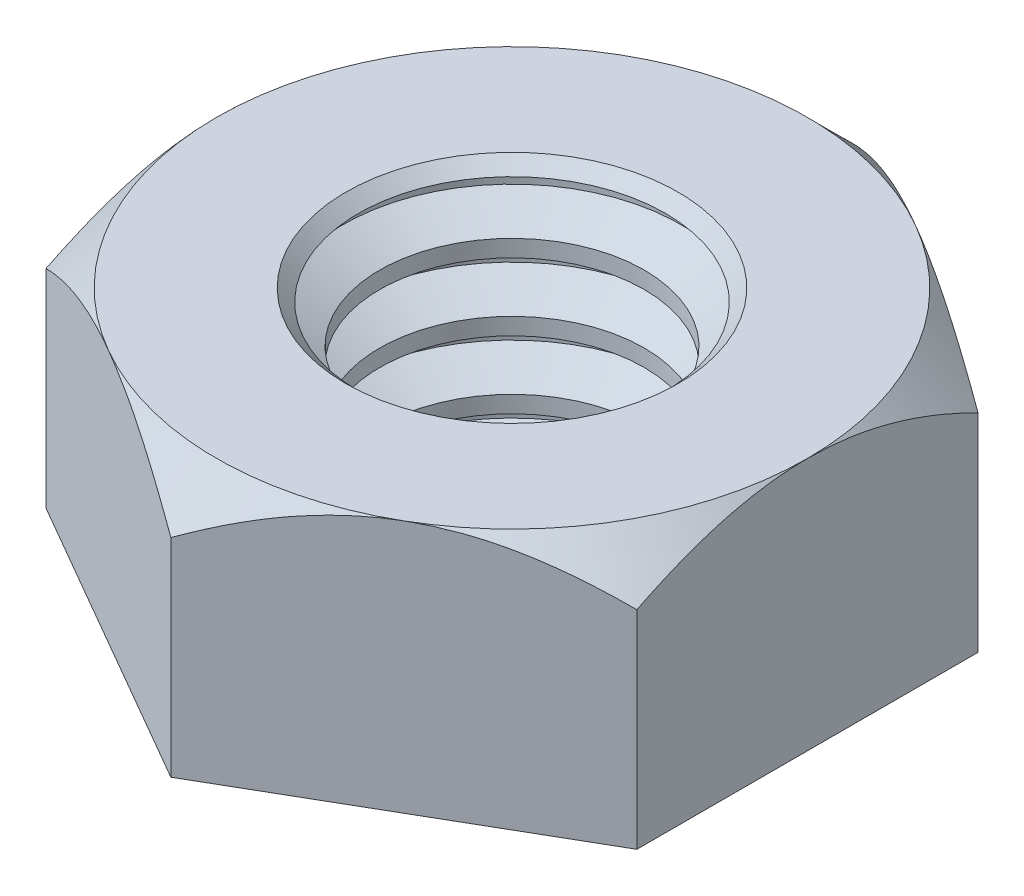
ISO-10303-21;
HEADER;
FILE_DESCRIPTION(('STEP AP214'),'2;1');
FILE_NAME('part.step','',(''),(''),'','','');
FILE_SCHEMA(('AUTOMOTIVE_DESIGN { 1 0 10303 214 1 1 1 1 }'));
ENDSEC;
DATA;
#1=APPLICATION_CONTEXT('core data for automotive mechanical design processes');
#2=APPLICATION_PROTOCOL_DEFINITION('international standard','automotive_design',2000,#1);
#3=PRODUCT_CONTEXT('',#1,'mechanical');
#4=PRODUCT('Part','Part','',(#3));
#5=PRODUCT_RELATED_PRODUCT_CATEGORY('part','',(#4));
#6=PRODUCT_DEFINITION_FORMATION('','',#4);
#7=PRODUCT_DEFINITION_CONTEXT('part definition',#1,'design');
#8=PRODUCT_DEFINITION('design','',#6,#7);
#9=PRODUCT_DEFINITION_SHAPE('','',#8);
#10=(LENGTH_UNIT() NAMED_UNIT(*) SI_UNIT(.MILLI.,.METRE.));
#11=(NAMED_UNIT(*) PLANE_ANGLE_UNIT() SI_UNIT($,.RADIAN.));
#12=(NAMED_UNIT(*) SI_UNIT($,.STERADIAN.) SOLID_ANGLE_UNIT());
#13=UNCERTAINTY_MEASURE_WITH_UNIT(LENGTH_MEASURE(1.E-05),#10,'distance_accuracy_value','');
#14=(GEOMETRIC_REPRESENTATION_CONTEXT(3) GLOBAL_UNCERTAINTY_ASSIGNED_CONTEXT((#13)) GLOBAL_UNIT_ASSIGNED_CONTEXT((#10,
#11,#12)) REPRESENTATION_CONTEXT('',''));
#15=CARTESIAN_POINT('',(0.,0.,0.));
#16=DIRECTION('',(0.,0.,1.));
#17=DIRECTION('',(1.,0.,0.));
#18=AXIS2_PLACEMENT_3D('',#15,#16,#17);
#19=CARTESIAN_POINT('',(0.,0.393578540984346,0.));
#20=DIRECTION('',(0.,1.,0.));
#21=DIRECTION('',(0.,0.,1.));
#22=AXIS2_PLACEMENT_3D('',#19,#20,#21);
#23=CYLINDRICAL_SURFACE('',#22,3.175);
#24=CARTESIAN_POINT('',(0.,3.09562500001448,0.));
#25=DIRECTION('',(0.,-1.,0.));
#26=DIRECTION('',(0.,0.,-1.));
#27=AXIS2_PLACEMENT_3D('',#24,#25,#26);
#28=CIRCLE('',#27,3.17499999994197);
#29=CARTESIAN_POINT('',(0.,3.09562500001448,-3.17499999994197));
#30=VERTEX_POINT('',#29);
#31=EDGE_CURVE('E398',#30,#30,#28,.F.);
#32=ORIENTED_EDGE('',*,*,#31,.T.);
#33=EDGE_LOOP('',(#32));
#34=FACE_BOUND('',#33,.T.);
#35=CARTESIAN_POINT('',(0.,2.9368750000458,0.));
#36=DIRECTION('',(0.,1.,0.));
#37=DIRECTION('',(0.,0.,1.));
#38=AXIS2_PLACEMENT_3D('',#35,#36,#37);
#39=CIRCLE('',#38,3.17499999999882);
#40=CARTESIAN_POINT('',(0.,2.9368750000458,3.17499999999882));
#41=VERTEX_POINT('',#40);
#42=EDGE_CURVE('E394',#41,#41,#39,.F.);
#43=ORIENTED_EDGE('',*,*,#42,.T.);
#44=EDGE_LOOP('',(#43));
#45=FACE_BOUND('',#44,.T.);
#46=ADVANCED_FACE('F17',(#34,#45),#23,.F.);
#47=CARTESIAN_POINT('',(0.,3.09562500001448,0.));
#48=DIRECTION('',(0.,-1.,0.));
#49=DIRECTION('',(1.,0.,0.));
#50=AXIS2_PLACEMENT_3D('',#47,#48,#49);
#51=CONICAL_SURFACE('',#50,3.17499999994197,1.04719755118736);
#52=ORIENTED_EDGE('',*,*,#31,.F.);
#53=EDGE_LOOP('',(#52));
#54=FACE_BOUND('',#53,.T.);
#55=CARTESIAN_POINT('',(0.,3.4925,0.));
#56=DIRECTION('',(0.,1.,0.));
#57=DIRECTION('',(0.,0.,1.));
#58=AXIS2_PLACEMENT_3D('',#55,#56,#57);
#59=CIRCLE('',#58,2.4875923357462);
#60=CARTESIAN_POINT('',(0.,3.4925,2.4875923357462));
#61=VERTEX_POINT('',#60);
#62=EDGE_CURVE('E390',#61,#61,#59,.T.);
#63=ORIENTED_EDGE('',*,*,#62,.T.);
#64=EDGE_LOOP('',(#63));
#65=FACE_BOUND('',#64,.T.);
#66=ADVANCED_FACE('F211',(#54,#65),#51,.F.);
#67=CARTESIAN_POINT('',(0.,2.9368750000458,0.));
#68=DIRECTION('',(0.,1.,0.));
#69=DIRECTION('',(0.,0.,1.));
#70=AXIS2_PLACEMENT_3D('',#67,#68,#69);
#71=CONICAL_SURFACE('',#70,3.17499999999882,1.04719755119695);
#72=ORIENTED_EDGE('',*,*,#42,.F.);
#73=EDGE_LOOP('',(#72));
#74=FACE_BOUND('',#73,.T.);
#75=CARTESIAN_POINT('',(0.,2.54,0.));
#76=DIRECTION('',(0.,1.,0.));
#77=DIRECTION('',(0.,0.,1.));
#78=AXIS2_PLACEMENT_3D('',#75,#76,#77);
#79=CIRCLE('',#78,2.4875923357462);
#80=CARTESIAN_POINT('',(0.,2.54,2.4875923357462));
#81=VERTEX_POINT('',#80);
#82=EDGE_CURVE('E386',#81,#81,#79,.F.);
#83=ORIENTED_EDGE('',*,*,#82,.T.);
#84=EDGE_LOOP('',(#83));
#85=FACE_BOUND('',#84,.T.);
#86=ADVANCED_FACE('F208',(#74,#85),#71,.F.);
#87=CARTESIAN_POINT('',(0.,1.66357854098435,0.));
#88=DIRECTION('',(0.,1.,0.));
#89=DIRECTION('',(0.,0.,1.));
#90=AXIS2_PLACEMENT_3D('',#87,#88,#89);
#91=CYLINDRICAL_SURFACE('',#90,2.4875923357462);
#92=CARTESIAN_POINT('',(0.,3.80999999998721,0.));
#93=DIRECTION('',(0.,1.,0.));
#94=DIRECTION('',(0.,0.,1.));
#95=AXIS2_PLACEMENT_3D('',#92,#93,#94);
#96=CIRCLE('',#95,2.48759233568308);
#97=CARTESIAN_POINT('',(0.,3.80999999998721,2.48759233568308));
#98=VERTEX_POINT('',#97);
#99=EDGE_CURVE('E382',#98,#98,#96,.T.);
#100=ORIENTED_EDGE('',*,*,#99,.T.);
#101=EDGE_LOOP('',(#100));
#102=FACE_BOUND('',#101,.T.);
#103=ORIENTED_EDGE('',*,*,#62,.F.);
#104=EDGE_LOOP('',(#103));
#105=FACE_BOUND('',#104,.T.);
#106=ADVANCED_FACE('F204',(#102,#105),#91,.F.);
#107=CARTESIAN_POINT('',(0.,0.393578540984346,0.));
#108=DIRECTION('',(0.,1.,0.));
#109=DIRECTION('',(0.,0.,1.));
#110=AXIS2_PLACEMENT_3D('',#107,#108,#109);
#111=CYLINDRICAL_SURFACE('',#110,2.4875923357462);
#112=ORIENTED_EDGE('',*,*,#82,.F.);
#113=EDGE_LOOP('',(#112));
#114=FACE_BOUND('',#113,.T.);
#115=CARTESIAN_POINT('',(0.,2.22250000001623,0.));
#116=DIRECTION('',(0.,-1.,0.));
#117=DIRECTION('',(0.,0.,-1.));
#118=AXIS2_PLACEMENT_3D('',#115,#116,#117);
#119=CIRCLE('',#118,2.48759233568308);
#120=CARTESIAN_POINT('',(0.,2.22250000001623,-2.48759233568308));
#121=VERTEX_POINT('',#120);
#122=EDGE_CURVE('E378',#121,#121,#119,.T.);
#123=ORIENTED_EDGE('',*,*,#122,.T.);
#124=EDGE_LOOP('',(#123));
#125=FACE_BOUND('',#124,.T.);
#126=ADVANCED_FACE('F200',(#114,#125),#111,.F.);
#127=CARTESIAN_POINT('',(0.,4.20687500002259,0.));
#128=DIRECTION('',(0.,1.,0.));
#129=DIRECTION('',(0.,0.,1.));
#130=AXIS2_PLACEMENT_3D('',#127,#128,#129);
#131=CONICAL_SURFACE('',#130,3.17499999999882,1.04719755119695);
#132=CARTESIAN_POINT('',(0.,4.206875,0.));
#133=DIRECTION('',(0.,1.,0.));
#134=DIRECTION('',(0.,0.,1.));
#135=AXIS2_PLACEMENT_3D('',#132,#133,#134);
#136=CIRCLE('',#135,3.175);
#137=CARTESIAN_POINT('',(0.,4.206875,3.175));
#138=VERTEX_POINT('',#137);
#139=EDGE_CURVE('E374',#138,#138,#136,.T.);
#140=ORIENTED_EDGE('',*,*,#139,.T.);
#141=EDGE_LOOP('',(#140));
#142=FACE_BOUND('',#141,.T.);
#143=ORIENTED_EDGE('',*,*,#99,.F.);
#144=EDGE_LOOP('',(#143));
#145=FACE_BOUND('',#144,.T.);
#146=ADVANCED_FACE('F196',(#142,#145),#131,.F.);
#147=CARTESIAN_POINT('',(0.,1.82562499998085,0.));
#148=DIRECTION('',(0.,-1.,0.));
#149=DIRECTION('',(0.,0.,-1.));
#150=AXIS2_PLACEMENT_3D('',#147,#148,#149);
#151=CONICAL_SURFACE('',#150,3.17499999999882,1.04719755119695);
#152=CARTESIAN_POINT('',(0.,1.825625,0.));
#153=DIRECTION('',(0.,1.,0.));
#154=DIRECTION('',(0.,0.,1.));
#155=AXIS2_PLACEMENT_3D('',#152,#153,#154);
#156=CIRCLE('',#155,3.175);
#157=CARTESIAN_POINT('',(0.,1.825625,3.175));
#158=VERTEX_POINT('',#157);
#159=EDGE_CURVE('E370',#158,#158,#156,.F.);
#160=ORIENTED_EDGE('',*,*,#159,.T.);
#161=EDGE_LOOP('',(#160));
#162=FACE_BOUND('',#161,.T.);
#163=ORIENTED_EDGE('',*,*,#122,.F.);
#164=EDGE_LOOP('',(#163));
#165=FACE_BOUND('',#164,.T.);
#166=ADVANCED_FACE('F192',(#162,#165),#151,.F.);
#167=CARTESIAN_POINT('',(0.,1.66357854098435,0.));
#168=DIRECTION('',(0.,1.,0.));
#169=DIRECTION('',(0.,0.,1.));
#170=AXIS2_PLACEMENT_3D('',#167,#168,#169);
#171=CYLINDRICAL_SURFACE('',#170,3.175);
#172=CARTESIAN_POINT('',(0.,4.36562499999127,0.));
#173=DIRECTION('',(0.,-1.,0.));
#174=DIRECTION('',(0.,0.,-1.));
#175=AXIS2_PLACEMENT_3D('',#172,#173,#174);
#176=CIRCLE('',#175,3.17499999994197);
#177=CARTESIAN_POINT('',(0.,4.36562499999127,-3.17499999994197));
#178=VERTEX_POINT('',#177);
#179=EDGE_CURVE('E366',#178,#178,#176,.F.);
#180=ORIENTED_EDGE('',*,*,#179,.T.);
#181=EDGE_LOOP('',(#180));
#182=FACE_BOUND('',#181,.T.);
#183=ORIENTED_EDGE('',*,*,#139,.F.);
#184=EDGE_LOOP('',(#183));
#185=FACE_BOUND('',#184,.T.);
#186=ADVANCED_FACE('F188',(#182,#185),#171,.F.);
#187=CARTESIAN_POINT('',(0.,-0.876421459015654,0.));
#188=DIRECTION('',(0.,1.,0.));
#189=DIRECTION('',(0.,0.,1.));
#190=AXIS2_PLACEMENT_3D('',#187,#188,#189);
#191=CYLINDRICAL_SURFACE('',#190,3.175);
#192=ORIENTED_EDGE('',*,*,#159,.F.);
#193=EDGE_LOOP('',(#192));
#194=FACE_BOUND('',#193,.T.);
#195=CARTESIAN_POINT('',(0.,1.66687500006901,0.));
#196=DIRECTION('',(0.,1.,0.));
#197=DIRECTION('',(0.,0.,1.));
#198=AXIS2_PLACEMENT_3D('',#195,#196,#197);
#199=CIRCLE('',#198,3.17499999999882);
#200=CARTESIAN_POINT('',(0.,1.66687500006901,3.17499999999882));
#201=VERTEX_POINT('',#200);
#202=EDGE_CURVE('E362',#201,#201,#199,.F.);
#203=ORIENTED_EDGE('',*,*,#202,.T.);
#204=EDGE_LOOP('',(#203));
#205=FACE_BOUND('',#204,.T.);
#206=ADVANCED_FACE('F184',(#194,#205),#191,.F.);
#207=CARTESIAN_POINT('',(0.,4.36562499999127,0.));
#208=DIRECTION('',(0.,-1.,0.));
#209=DIRECTION('',(0.,0.,-1.));
#210=AXIS2_PLACEMENT_3D('',#207,#208,#209);
#211=CONICAL_SURFACE('',#210,3.17499999994197,1.04719755113822);
#212=ORIENTED_EDGE('',*,*,#179,.F.);
#213=EDGE_LOOP('',(#212));
#214=FACE_BOUND('',#213,.T.);
#215=CARTESIAN_POINT('',(0.,4.53007386857962,0.));
#216=DIRECTION('',(0.,1.,0.));
#217=DIRECTION('',(0.,0.,1.));
#218=AXIS2_PLACEMENT_3D('',#215,#216,#217);
#219=CIRCLE('',#218,2.89016620433813);
#220=CARTESIAN_POINT('',(0.,4.53007386857962,2.89016620433813));
#221=VERTEX_POINT('',#220);
#222=EDGE_CURVE('E358',#221,#221,#219,.T.);
#223=ORIENTED_EDGE('',*,*,#222,.T.);
#224=EDGE_LOOP('',(#223));
#225=FACE_BOUND('',#224,.T.);
#226=ADVANCED_FACE('F180',(#214,#225),#211,.F.);
#227=CARTESIAN_POINT('',(0.,1.66687500006901,0.));
#228=DIRECTION('',(0.,1.,0.));
#229=DIRECTION('',(-1.,0.,0.));
#230=AXIS2_PLACEMENT_3D('',#227,#228,#229);
#231=CONICAL_SURFACE('',#230,3.17499999999882,1.04719755119695);
#232=ORIENTED_EDGE('',*,*,#202,.F.);
#233=EDGE_LOOP('',(#232));
#234=FACE_BOUND('',#233,.T.);
#235=CARTESIAN_POINT('',(0.,1.27,0.));
#236=DIRECTION('',(0.,1.,0.));
#237=DIRECTION('',(0.,0.,1.));
#238=AXIS2_PLACEMENT_3D('',#235,#236,#237);
#239=CIRCLE('',#238,2.4875923357462);
#240=CARTESIAN_POINT('',(0.,1.27,2.4875923357462));
#241=VERTEX_POINT('',#240);
#242=EDGE_CURVE('E354',#241,#241,#239,.F.);
#243=ORIENTED_EDGE('',*,*,#242,.T.);
#244=EDGE_LOOP('',(#243));
#245=FACE_BOUND('',#244,.T.);
#246=ADVANCED_FACE('F176',(#234,#245),#231,.F.);
#247=CARTESIAN_POINT('',(0.,4.7624999999698,0.));
#248=DIRECTION('',(0.,1.,0.));
#249=DIRECTION('',(0.,0.,1.));
#250=AXIS2_PLACEMENT_3D('',#247,#248,#249);
#251=CONICAL_SURFACE('',#250,3.12259233572831,0.785398163397448);
#252=CARTESIAN_POINT('',(0.,4.76250000002665,0.));
#253=DIRECTION('',(0.,1.,0.));
#254=DIRECTION('',(0.,0.,1.));
#255=AXIS2_PLACEMENT_3D('',#252,#253,#254);
#256=CIRCLE('',#255,3.12259233578516);
#257=CARTESIAN_POINT('',(0.,4.76250000002665,3.12259233578516));
#258=VERTEX_POINT('',#257);
#259=EDGE_CURVE('E20',#258,#258,#256,.F.);
#260=ORIENTED_EDGE('',*,*,#259,.F.);
#261=EDGE_LOOP('',(#260));
#262=FACE_BOUND('',#261,.T.);
#263=ORIENTED_EDGE('',*,*,#222,.F.);
#264=EDGE_LOOP('',(#263));
#265=FACE_BOUND('',#264,.T.);
#266=ADVANCED_FACE('F172',(#262,#265),#251,.F.);
#267=CARTESIAN_POINT('',(0.,-0.876421459015654,0.));
#268=DIRECTION('',(0.,1.,0.));
#269=DIRECTION('',(0.,0.,1.));
#270=AXIS2_PLACEMENT_3D('',#267,#268,#269);
#271=CYLINDRICAL_SURFACE('',#270,2.4875923357462);
#272=ORIENTED_EDGE('',*,*,#242,.F.);
#273=EDGE_LOOP('',(#272));
#274=FACE_BOUND('',#273,.T.);
#275=CARTESIAN_POINT('',(0.,0.952499999982592,0.));
#276=DIRECTION('',(0.,-1.,0.));
#277=DIRECTION('',(0.,0.,-1.));
#278=AXIS2_PLACEMENT_3D('',#275,#276,#277);
#279=CIRCLE('',#278,2.48759233568308);
#280=CARTESIAN_POINT('',(0.,0.952499999982592,-2.48759233568308));
#281=VERTEX_POINT('',#280);
#282=EDGE_CURVE('E119',#281,#281,#279,.T.);
#283=ORIENTED_EDGE('',*,*,#282,.T.);
#284=EDGE_LOOP('',(#283));
#285=FACE_BOUND('',#284,.T.);
#286=ADVANCED_FACE('F168',(#274,#285),#271,.F.);
#287=CARTESIAN_POINT('',(0.,4.7625,-6.4158048663707));
#288=DIRECTION('',(0.,1.,0.));
#289=DIRECTION('',(0.,0.,1.));
#290=AXIS2_PLACEMENT_3D('',#287,#288,#289);
#291=PLANE('',#290);
#292=ORIENTED_EDGE('',*,*,#259,.T.);
#293=EDGE_LOOP('',(#292));
#294=FACE_BOUND('',#293,.T.);
#295=CARTESIAN_POINT('',(0.,4.76250000002665,0.));
#296=DIRECTION('',(0.,-1.,0.));
#297=DIRECTION('',(1.,0.,0.));
#298=AXIS2_PLACEMENT_3D('',#295,#296,#297);
#299=CIRCLE('',#298,5.55624999998372);
#300=CARTESIAN_POINT('',(-2.77812499999628,4.76250000001881,4.81185364976968));
#301=VERTEX_POINT('',#300);
#302=CARTESIAN_POINT('',(-5.55624999999186,4.76250000001851,0.));
#303=VERTEX_POINT('',#302);
#304=EDGE_CURVE('E106',#301,#303,#299,.T.);
#305=ORIENTED_EDGE('',*,*,#304,.F.);
#306=CARTESIAN_POINT('',(0.,4.76250000002665,0.));
#307=DIRECTION('',(0.,-1.,0.));
#308=DIRECTION('',(1.,0.,0.));
#309=AXIS2_PLACEMENT_3D('',#306,#307,#308);
#310=CIRCLE('',#309,5.55624999998372);
#311=CARTESIAN_POINT('',(2.77812499999663,4.76250000001811,4.81185364977029));
#312=VERTEX_POINT('',#311);
#313=EDGE_CURVE('E439',#312,#301,#310,.T.);
#314=ORIENTED_EDGE('',*,*,#313,.F.);
#315=CARTESIAN_POINT('',(0.,4.76250000002665,0.));
#316=DIRECTION('',(0.,-1.,0.));
#317=DIRECTION('',(1.,0.,0.));
#318=AXIS2_PLACEMENT_3D('',#315,#316,#317);
#319=CIRCLE('',#318,5.55624999998372);
#320=CARTESIAN_POINT('',(5.55624999999186,4.76250000001851,0.));
#321=VERTEX_POINT('',#320);
#322=EDGE_CURVE('E435',#321,#312,#319,.T.);
#323=ORIENTED_EDGE('',*,*,#322,.F.);
#324=CARTESIAN_POINT('',(0.,4.76250000002665,0.));
#325=DIRECTION('',(0.,-1.,0.));
#326=DIRECTION('',(1.,0.,0.));
#327=AXIS2_PLACEMENT_3D('',#324,#325,#326);
#328=CIRCLE('',#327,5.55624999998372);
#329=CARTESIAN_POINT('',(2.77812499999628,4.76250000001881,-4.81185364976968));
#330=VERTEX_POINT('',#329);
#331=EDGE_CURVE('E113',#330,#321,#328,.T.);
#332=ORIENTED_EDGE('',*,*,#331,.F.);
#333=CARTESIAN_POINT('',(0.,4.76250000002665,0.));
#334=DIRECTION('',(0.,-1.,0.));
#335=DIRECTION('',(1.,0.,0.));
#336=AXIS2_PLACEMENT_3D('',#333,#334,#335);
#337=CIRCLE('',#336,5.55624999998372);
#338=CARTESIAN_POINT('',(-2.77812499999664,4.76250000001811,-4.81185364977029));
#339=VERTEX_POINT('',#338);
#340=EDGE_CURVE('E107',#339,#330,#337,.T.);
#341=ORIENTED_EDGE('',*,*,#340,.F.);
#342=CARTESIAN_POINT('',(0.,4.76250000002665,0.));
#343=DIRECTION('',(0.,-1.,0.));
#344=DIRECTION('',(1.,0.,0.));
#345=AXIS2_PLACEMENT_3D('',#342,#343,#344);
#346=CIRCLE('',#345,5.55624999998372);
#347=EDGE_CURVE('E95',#303,#339,#346,.T.);
#348=ORIENTED_EDGE('',*,*,#347,.F.);
#349=EDGE_LOOP('',(#305,#314,#323,#332,#341,#348));
#350=FACE_BOUND('',#349,.T.);
#351=ADVANCED_FACE('F111',(#294,#350),#291,.T.);
#352=CARTESIAN_POINT('',(0.,0.555624999947213,0.));
#353=DIRECTION('',(0.,-1.,0.));
#354=DIRECTION('',(0.,0.,-1.));
#355=AXIS2_PLACEMENT_3D('',#352,#353,#354);
#356=CONICAL_SURFACE('',#355,3.17499999999882,1.04719755119695);
#357=CARTESIAN_POINT('',(0.,0.555625,0.));
#358=DIRECTION('',(0.,1.,0.));
#359=DIRECTION('',(0.,0.,1.));
#360=AXIS2_PLACEMENT_3D('',#357,#358,#359);
#361=CIRCLE('',#360,3.175);
#362=CARTESIAN_POINT('',(0.,0.555625,3.175));
#363=VERTEX_POINT('',#362);
#364=EDGE_CURVE('E347',#363,#363,#361,.F.);
#365=ORIENTED_EDGE('',*,*,#364,.T.);
#366=EDGE_LOOP('',(#365));
#367=FACE_BOUND('',#366,.T.);
#368=ORIENTED_EDGE('',*,*,#282,.F.);
#369=EDGE_LOOP('',(#368));
#370=FACE_BOUND('',#369,.T.);
#371=ADVANCED_FACE('F159',(#367,#370),#356,.F.);
#372=CARTESIAN_POINT('',(0.,3.89778780441929,0.));
#373=DIRECTION('',(0.,-1.,0.));
#374=DIRECTION('',(1.,0.,0.));
#375=AXIS2_PLACEMENT_3D('',#372,#373,#374);
#376=CONICAL_SURFACE('',#375,6.42096219559107,0.785398163397448);
#377=CARTESIAN_POINT('',(6.89529481876337E-12,3.90294513363569,-6.41580486637468));
#378=CARTESIAN_POINT('',(-0.0961439627336396,3.95844532390917,-6.36029612360547));
#379=CARTESIAN_POINT('',(-0.193031372618446,4.01223140704246,-6.30435815142739));
#380=CARTESIAN_POINT('',(-0.388442880153431,4.1158515588541,-6.19153726494931));
#381=CARTESIAN_POINT('',(-0.48696788732396,4.16568333613507,-6.13465382553749));
#382=CARTESIAN_POINT('',(-0.786233155470481,4.30893021583434,-5.96187294241399));
#383=CARTESIAN_POINT('',(-0.989527323281032,4.39542607644725,-5.84450099990388));
#384=CARTESIAN_POINT('',(-1.39679382519758,4.54226484029359,-5.60936557539043));
#385=CARTESIAN_POINT('',(-1.60057473365511,4.60329477099655,-5.49171261303677));
#386=CARTESIAN_POINT('',(-1.90950287275686,4.67390060755758,-5.31335286876612));
#387=CARTESIAN_POINT('',(-2.01289305319051,4.6939342624413,-5.25366052026118));
#388=CARTESIAN_POINT('',(-2.22053696804989,4.72657892468336,-5.13377725012152));
#389=CARTESIAN_POINT('',(-2.32479041562654,4.73919230463678,-5.07358649409919));
#390=CARTESIAN_POINT('',(-2.48720348632817,4.75275478371739,-4.97981726400969));
#391=CARTESIAN_POINT('',(-2.54520323749661,4.7563969707123,-4.94633109205966));
#392=CARTESIAN_POINT('',(-2.66150851204991,4.76127574717194,-4.87918221048814));
#393=CARTESIAN_POINT('',(-2.71981433660856,4.76250275089465,-4.84551932698387));
#394=CARTESIAN_POINT('',(-2.7781250000009,4.76250000000958,-4.81185364977768));
#395=B_SPLINE_CURVE_WITH_KNOTS('',3,(#377,#378,#379,#380,#381,#382,#383,#384,#385,#386,#387,
#388,#389,#390,#391,#392,#393,#394),.UNSPECIFIED.,.F.,.F.,(4,2,2,2,2,2,2,2,4),(0.,
0.372329898560542,0.744873998685941,1.49437191124484,2.22208704225135,2.58505625060722,
2.94790933824143,3.14908452830525,3.35105657544868),.UNSPECIFIED.);
#396=CARTESIAN_POINT('',(-4.14845643128234E-12,3.90294513360576,-6.41580486637618));
#397=VERTEX_POINT('',#396);
#398=EDGE_CURVE('E123',#397,#339,#395,.T.);
#399=ORIENTED_EDGE('',*,*,#398,.T.);
#400=ORIENTED_EDGE('',*,*,#340,.T.);
#401=CARTESIAN_POINT('',(2.7781250000002,4.76250000001098,-4.81185364977647));
#402=CARTESIAN_POINT('',(2.70422010300177,4.76250683386859,-4.85452266195295));
#403=CARTESIAN_POINT('',(2.63032625467737,4.76053296312236,-4.89718529517449));
#404=CARTESIAN_POINT('',(2.48270514010945,4.75268818889449,-4.98241438540836));
#405=CARTESIAN_POINT('',(2.40897784949196,4.74681789843701,-5.02498085649299));
#406=CARTESIAN_POINT('',(2.18851839188986,4.72348875962961,-5.15226318368497));
#407=CARTESIAN_POINT('',(2.04221555352049,4.70031113471673,-5.23673116680073));
#408=CARTESIAN_POINT('',(1.75404619816196,4.64038711787945,-5.40310582168919));
#409=CARTESIAN_POINT('',(1.61214605160571,4.60385063940647,-5.48503190950149));
#410=CARTESIAN_POINT('',(1.33103821297734,4.51879780784092,-5.6473295958049));
#411=CARTESIAN_POINT('',(1.19183137890336,4.47027770278872,-5.72770069893055));
#412=CARTESIAN_POINT('',(0.964166818617999,4.38161278368557,-5.85914289409625));
#413=CARTESIAN_POINT('',(0.874838339318478,4.34439154490662,-5.91071671566613));
#414=CARTESIAN_POINT('',(0.697489715297436,4.26606247520845,-6.01310899148509));
#415=CARTESIAN_POINT('',(0.60946929913544,4.22495546404838,-6.06392760245041));
#416=CARTESIAN_POINT('',(0.433800560669882,4.13884739400589,-6.1653499958917));
#417=CARTESIAN_POINT('',(0.346165497068739,4.09381046496169,-6.21594612345228));
#418=CARTESIAN_POINT('',(0.172153338619018,4.00061747121535,-6.31641208997549));
#419=CARTESIAN_POINT('',(0.0857761604583926,3.95246161424692,-6.36628197703837));
#420=CARTESIAN_POINT('',(-8.29734049397602E-12,3.9029451336365,-6.41580486637387));
#421=B_SPLINE_CURVE_WITH_KNOTS('',3,(#401,#402,#403,#404,#405,#406,#407,#408,#409,#410,#411,
#412,#413,#414,#415,#416,#417,#418,#419,#420),.UNSPECIFIED.,.F.,.F.,(4,2,2,2,2,2,2,2,2,4),(0.,
0.255966854117835,0.511893446484439,1.02273516810609,1.52587247624435,2.02916751203038,
2.3580672176173,2.68689769131415,3.01912834655067,3.35133689654081),.UNSPECIFIED.);
#422=EDGE_CURVE('E129',#330,#397,#421,.T.);
#423=ORIENTED_EDGE('',*,*,#422,.T.);
#424=EDGE_LOOP('',(#399,#400,#423));
#425=FACE_BOUND('',#424,.T.);
#426=ADVANCED_FACE('F128',(#425),#376,.T.);
#427=CARTESIAN_POINT('',(0.,3.89778780441929,0.));
#428=DIRECTION('',(0.,-1.,0.));
#429=DIRECTION('',(1.,0.,0.));
#430=AXIS2_PLACEMENT_3D('',#427,#428,#429);
#431=CONICAL_SURFACE('',#430,6.42096219559107,0.785398163397448);
#432=ORIENTED_EDGE('',*,*,#347,.T.);
#433=CARTESIAN_POINT('',(-2.7781250000009,4.76250000000958,-4.81185364977768));
#434=CARTESIAN_POINT('',(-2.85202989699936,4.76250683386717,-4.76918463760118));
#435=CARTESIAN_POINT('',(-2.92592374532378,4.76053296312092,-4.72652200437962));
#436=CARTESIAN_POINT('',(-3.07354485989176,4.75268818889303,-4.64129291414572));
#437=CARTESIAN_POINT('',(-3.14727215050928,4.74681789843553,-4.59872644306107));
#438=CARTESIAN_POINT('',(-3.36773160811146,4.72348875962807,-4.47144411586905));
#439=CARTESIAN_POINT('',(-3.51403444648088,4.70031113471515,-4.38697613275326));
#440=CARTESIAN_POINT('',(-3.80220380183951,4.64038711787779,-4.22060147786474));
#441=CARTESIAN_POINT('',(-3.9441039483958,4.60385063940477,-4.13867539005241));
#442=CARTESIAN_POINT('',(-4.22521178702427,4.51879780783913,-3.97637770374895));
#443=CARTESIAN_POINT('',(-4.3644186210983,4.47027770278688,-3.89600660062326));
#444=CARTESIAN_POINT('',(-4.59208318138322,4.38161278368387,-3.76456440545783));
#445=CARTESIAN_POINT('',(-4.68141166068225,4.34439154490512,-3.71299058388823));
#446=CARTESIAN_POINT('',(-4.85876028470233,4.26606247520739,-3.61059830806982));
#447=CARTESIAN_POINT('',(-4.94678070086386,4.22495546404756,-3.55977969710478));
#448=CARTESIAN_POINT('',(-5.12244943932847,4.1388473940056,-3.45835730366403));
#449=CARTESIAN_POINT('',(-5.21008450292914,4.09381046496168,-3.40776117610373));
#450=CARTESIAN_POINT('',(-5.38409666137794,4.00061747121594,-3.30729520958104));
#451=CARTESIAN_POINT('',(-5.47047383953811,3.95246161424782,-3.25742532251843));
#452=CARTESIAN_POINT('',(-5.55625000000435,3.90294513363772,-3.20790243318319));
#453=B_SPLINE_CURVE_WITH_KNOTS('',3,(#433,#434,#435,#436,#437,#438,#439,#440,#441,#442,#443,
#444,#445,#446,#447,#448,#449,#450,#451,#452),.UNSPECIFIED.,.F.,.F.,(4,2,2,2,2,2,2,2,2,4),(0.,
0.255966854117931,0.511893446484631,1.02273516810647,1.52587247624493,2.02916751203115,
2.35806721761629,2.68689769131135,3.01912834654604,3.35133689653435),.UNSPECIFIED.);
#454=CARTESIAN_POINT('',(-5.55625000000217,3.90294513363811,-3.20790243318618));
#455=VERTEX_POINT('',#454);
#456=EDGE_CURVE('E99',#339,#455,#453,.T.);
#457=ORIENTED_EDGE('',*,*,#456,.T.);
#458=CARTESIAN_POINT('',(-5.55625,3.9029451336385,-3.20790243318916));
#459=CARTESIAN_POINT('',(-5.55625,3.95844532391186,-3.09688494765089));
#460=CARTESIAN_POINT('',(-5.55625,4.01223140704504,-2.98500900329486));
#461=CARTESIAN_POINT('',(-5.55625,4.11585155885646,-2.75936723033898));
#462=CARTESIAN_POINT('',(-5.55625,4.16568333613731,-2.64560035151549));
#463=CARTESIAN_POINT('',(-5.55625,4.30893021583627,-2.30003858526891));
#464=CARTESIAN_POINT('',(-5.55625,4.39542607644897,-2.065294700249));
#465=CARTESIAN_POINT('',(-5.55625,4.54226484029497,-1.59502385122271));
#466=CARTESIAN_POINT('',(-5.55625,4.60329477099778,-1.35971792651568));
#467=CARTESIAN_POINT('',(-5.55625,4.67390060755863,-1.00299843797484));
#468=CARTESIAN_POINT('',(-5.55625,4.69393426244229,-0.883613740965121));
#469=CARTESIAN_POINT('',(-5.55625,4.72657892468427,-0.643847200686133));
#470=CARTESIAN_POINT('',(-5.55625,4.73919230463765,-0.523465688641635));
#471=CARTESIAN_POINT('',(-5.55625,4.75275478371821,-0.33592722846299));
#472=CARTESIAN_POINT('',(-5.55625,4.7563969707131,-0.268954884563141));
#473=CARTESIAN_POINT('',(-5.55625,4.76127574717273,-0.134657121420506));
#474=CARTESIAN_POINT('',(-5.55625,4.76250275089544,-0.0673313544121817));
#475=CARTESIAN_POINT('',(-5.55625,4.76250000001037,0.));
#476=B_SPLINE_CURVE_WITH_KNOTS('',3,(#458,#459,#460,#461,#462,#463,#464,#465,#466,#467,#468,
#469,#470,#471,#472,#473,#474,#475),.UNSPECIFIED.,.F.,.F.,(4,2,2,2,2,2,2,2,4),(0.,
0.372329898560033,0.744873998684922,1.49437191124278,2.22208704224833,2.58505625060373,
2.94790933823745,3.14908452830066,3.35105657544348),.UNSPECIFIED.);
#477=EDGE_CURVE('E101',#455,#303,#476,.T.);
#478=ORIENTED_EDGE('',*,*,#477,.T.);
#479=EDGE_LOOP('',(#432,#457,#478));
#480=FACE_BOUND('',#479,.T.);
#481=ADVANCED_FACE('F97',(#480),#431,.T.);
#482=CARTESIAN_POINT('',(0.,3.89778780441929,0.));
#483=DIRECTION('',(0.,-1.,0.));
#484=DIRECTION('',(1.,0.,0.));
#485=AXIS2_PLACEMENT_3D('',#482,#483,#484);
#486=CONICAL_SURFACE('',#485,6.42096219559107,0.785398163397448);
#487=ORIENTED_EDGE('',*,*,#304,.T.);
#488=CARTESIAN_POINT('',(-5.55625,4.76250000001037,0.));
#489=CARTESIAN_POINT('',(-5.55625,4.76250683386797,0.0853380243529699));
#490=CARTESIAN_POINT('',(-5.55625,4.76053296312173,0.170663290796078));
#491=CARTESIAN_POINT('',(-5.55625,4.75268818889385,0.341121471263835));
#492=CARTESIAN_POINT('',(-5.55625,4.74681789843636,0.426254413433107));
#493=CARTESIAN_POINT('',(-5.55625,4.72348875962893,0.680819067817092));
#494=CARTESIAN_POINT('',(-5.55625,4.70031113471603,0.849755034048642));
#495=CARTESIAN_POINT('',(-5.55625,4.64038711787871,1.1825043438256));
#496=CARTESIAN_POINT('',(-5.55625,4.60385063940571,1.34635651945022));
#497=CARTESIAN_POINT('',(-5.55625,4.51879780784012,1.67095189205708));
#498=CARTESIAN_POINT('',(-5.55625,4.4702777027879,1.83169409830841));
#499=CARTESIAN_POINT('',(-5.55625,4.3816127836849,2.09457848863927));
#500=CARTESIAN_POINT('',(-5.55625,4.34439154490615,2.19772613177849));
#501=CARTESIAN_POINT('',(-5.55625,4.26606247520842,2.40251068341535));
#502=CARTESIAN_POINT('',(-5.55625,4.22495546404859,2.50414790534545));
#503=CARTESIAN_POINT('',(-5.55625,4.13884739400661,2.706992692227));
#504=CARTESIAN_POINT('',(-5.55625,4.09381046496268,2.80818494734762));
#505=CARTESIAN_POINT('',(-5.55625,4.00061747121693,3.00911688039303));
#506=CARTESIAN_POINT('',(-5.55625,3.9524616142488,3.10885665451828));
#507=CARTESIAN_POINT('',(-5.55625,3.90294513363869,3.20790243318878));
#508=B_SPLINE_CURVE_WITH_KNOTS('',3,(#488,#489,#490,#491,#492,#493,#494,#495,#496,#497,#498,
#499,#500,#501,#502,#503,#504,#505,#506,#507),.UNSPECIFIED.,.F.,.F.,(4,2,2,2,2,2,2,2,2,4),(0.,
0.255966854117877,0.511893446484525,1.02273516810626,1.52587247624461,2.02916751203073,
2.35806721761594,2.68689769131107,3.01912834654583,3.35133689653421),.UNSPECIFIED.);
#509=CARTESIAN_POINT('',(-5.55625000000203,3.90294513363869,3.20790243318525));
#510=VERTEX_POINT('',#509);
#511=EDGE_CURVE('E308',#303,#510,#508,.T.);
#512=ORIENTED_EDGE('',*,*,#511,.T.);
#513=CARTESIAN_POINT('',(-5.55625000000407,3.90294513363869,3.20790243318173));
#514=CARTESIAN_POINT('',(-5.46010603726363,3.95844532391208,3.26341117595088));
#515=CARTESIAN_POINT('',(-5.36321862737892,4.01223140704528,3.31934914812891));
#516=CARTESIAN_POINT('',(-5.16780711984414,4.11585155885675,3.43217003460687));
#517=CARTESIAN_POINT('',(-5.06928211267371,4.16568333613762,3.48905347401863));
#518=CARTESIAN_POINT('',(-4.77001684452751,4.30893021583664,3.66183435714195));
#519=CARTESIAN_POINT('',(-4.56672267671718,4.39542607644938,3.77920629965193));
#520=CARTESIAN_POINT('',(-4.15945617480106,4.54226484029545,4.01434172416513));
#521=CARTESIAN_POINT('',(-3.95567526634375,4.60329477099829,4.13199468651867));
#522=CARTESIAN_POINT('',(-3.64674712724233,4.67390060755918,4.31035443078913));
#523=CARTESIAN_POINT('',(-3.54335694680879,4.69393426244286,4.37004677929401));
#524=CARTESIAN_POINT('',(-3.33571303194964,4.72657892468485,4.48993004943353));
#525=CARTESIAN_POINT('',(-3.2314595843731,4.73919230463824,4.55012080545579));
#526=CARTESIAN_POINT('',(-3.0690465136718,4.75275478371881,4.6438900355451));
#527=CARTESIAN_POINT('',(-3.0110467625036,4.7563969707137,4.677376207495));
#528=CARTESIAN_POINT('',(-2.89474148795075,4.76127574717333,4.74452508906626));
#529=CARTESIAN_POINT('',(-2.83643566339231,4.76250275089604,4.7781879725704));
#530=CARTESIAN_POINT('',(-2.7781250000002,4.76250000001098,4.81185364977646));
#531=B_SPLINE_CURVE_WITH_KNOTS('',3,(#513,#514,#515,#516,#517,#518,#519,#520,#521,#522,#523,
#524,#525,#526,#527,#528,#529,#530),.UNSPECIFIED.,.F.,.F.,(4,2,2,2,2,2,2,2,4),(0.,
0.372329898560112,0.744873998685081,1.49437191124311,2.22208704224881,2.58505625060428,
2.94790933823808,3.14908452830113,3.35105657544378),.UNSPECIFIED.);
#532=EDGE_CURVE('E299',#510,#301,#531,.T.);
#533=ORIENTED_EDGE('',*,*,#532,.T.);
#534=EDGE_LOOP('',(#487,#512,#533));
#535=FACE_BOUND('',#534,.T.);
#536=ADVANCED_FACE('F275',(#535),#486,.T.);
#537=CARTESIAN_POINT('',(0.,3.89778780441929,0.));
#538=DIRECTION('',(0.,-1.,0.));
#539=DIRECTION('',(1.,0.,0.));
#540=AXIS2_PLACEMENT_3D('',#537,#538,#539);
#541=CONICAL_SURFACE('',#540,6.42096219559107,0.785398163397448);
#542=ORIENTED_EDGE('',*,*,#313,.T.);
#543=CARTESIAN_POINT('',(-2.7781250000002,4.76250000001098,4.81185364977646));
#544=CARTESIAN_POINT('',(-2.70422010300177,4.76250683386859,4.85452266195294));
#545=CARTESIAN_POINT('',(-2.63032625467737,4.76053296312236,4.89718529517449));
#546=CARTESIAN_POINT('',(-2.48270514010945,4.75268818889449,4.98241438540836));
#547=CARTESIAN_POINT('',(-2.40897784949196,4.74681789843701,5.02498085649299));
#548=CARTESIAN_POINT('',(-2.18851839188986,4.72348875962961,5.15226318368496));
#549=CARTESIAN_POINT('',(-2.04221555352049,4.70031113471673,5.23673116680073));
#550=CARTESIAN_POINT('',(-1.75404619816197,4.64038711787945,5.40310582168919));
#551=CARTESIAN_POINT('',(-1.61214605160572,4.60385063940647,5.48503190950149));
#552=CARTESIAN_POINT('',(-1.33103821297735,4.51879780784092,5.6473295958049));
#553=CARTESIAN_POINT('',(-1.19183137890336,4.47027770278872,5.72770069893055));
#554=CARTESIAN_POINT('',(-0.964166818618314,4.38161278368569,5.85914289409607));
#555=CARTESIAN_POINT('',(-0.874838339319102,4.34439154490688,5.91071671566577));
#556=CARTESIAN_POINT('',(-0.697489715298666,4.26606247520901,6.01310899148438));
#557=CARTESIAN_POINT('',(-0.60946929913697,4.2249554640491,6.06392760244952));
#558=CARTESIAN_POINT('',(-0.433800560672009,4.13884739400696,6.16534999589047));
#559=CARTESIAN_POINT('',(-0.346165497071163,4.09381046496295,6.21594612345088));
#560=CARTESIAN_POINT('',(-0.172153338622028,4.000617471217,6.31641208997376));
#561=CARTESIAN_POINT('',(-0.0857761604616915,3.95246161424878,6.36628197703647));
#562=CARTESIAN_POINT('',(4.71395640461881E-12,3.90294513363857,6.4158048663718));
#563=B_SPLINE_CURVE_WITH_KNOTS('',3,(#543,#544,#545,#546,#547,#548,#549,#550,#551,#552,#553,
#554,#555,#556,#557,#558,#559,#560,#561,#562),.UNSPECIFIED.,.F.,.F.,(4,2,2,2,2,2,2,2,2,4),(0.,
0.255966854117833,0.511893446484436,1.02273516810608,1.52587247624435,2.02916751203038,
2.35806721761616,2.68689769131186,3.01912834654722,3.35133689653619),.UNSPECIFIED.);
#564=CARTESIAN_POINT('',(7.28782888909489E-13,3.90294513363818,6.41580486637219));
#565=VERTEX_POINT('',#564);
#566=EDGE_CURVE('E280',#301,#565,#563,.T.);
#567=ORIENTED_EDGE('',*,*,#566,.T.);
#568=CARTESIAN_POINT('',(-3.25612052172617E-12,3.90294513363779,6.41580486637258));
#569=CARTESIAN_POINT('',(0.096143962737168,3.95844532391115,6.36029612360343));
#570=CARTESIAN_POINT('',(0.193031372621862,4.01223140704433,6.30435815142542));
#571=CARTESIAN_POINT('',(0.388442880156618,4.11585155885574,6.19153726494747));
#572=CARTESIAN_POINT('',(0.486967887327031,4.16568333613659,6.13465382553572));
#573=CARTESIAN_POINT('',(0.786233155473193,4.30893021583553,5.96187294241242));
#574=CARTESIAN_POINT('',(0.989527323283494,4.39542607644823,5.84450099990246));
#575=CARTESIAN_POINT('',(1.39679382519954,4.54226484029421,5.6093655753893));
#576=CARTESIAN_POINT('',(1.60057473365682,4.60329477099701,5.49171261303578));
#577=CARTESIAN_POINT('',(1.90950287275818,4.67390060755785,5.31335286876535));
#578=CARTESIAN_POINT('',(2.01289305319171,4.69393426244151,5.25366052026049));
#579=CARTESIAN_POINT('',(2.22053696805081,4.72657892468348,5.13377725012099));
#580=CARTESIAN_POINT('',(2.32479041562733,4.73919230463686,5.07358649409874));
#581=CARTESIAN_POINT('',(2.48720348632872,4.75275478371743,4.97981726400937));
#582=CARTESIAN_POINT('',(2.54520323749704,4.75639697071232,4.94633109205941));
#583=CARTESIAN_POINT('',(2.66150851205012,4.76127574717195,4.87918221048801));
#584=CARTESIAN_POINT('',(2.71981433660867,4.76250275089465,4.84551932698381));
#585=CARTESIAN_POINT('',(2.7781250000009,4.76250000000958,4.81185364977768));
#586=B_SPLINE_CURVE_WITH_KNOTS('',3,(#568,#569,#570,#571,#572,#573,#574,#575,#576,#577,#578,
#579,#580,#581,#582,#583,#584,#585),.UNSPECIFIED.,.F.,.F.,(4,2,2,2,2,2,2,2,4),(0.,
0.372329898560038,0.744873998684932,1.4943719112428,2.22208704224836,2.58505625060376,
2.94790933823749,3.14908452830093,3.35105657544398),.UNSPECIFIED.);
#587=EDGE_CURVE('E285',#565,#312,#586,.T.);
#588=ORIENTED_EDGE('',*,*,#587,.T.);
#589=EDGE_LOOP('',(#542,#567,#588));
#590=FACE_BOUND('',#589,.T.);
#591=ADVANCED_FACE('F268',(#590),#541,.T.);
#592=CARTESIAN_POINT('',(0.,3.89778780441929,0.));
#593=DIRECTION('',(0.,-1.,0.));
#594=DIRECTION('',(1.,0.,0.));
#595=AXIS2_PLACEMENT_3D('',#592,#593,#594);
#596=CONICAL_SURFACE('',#595,6.42096219559107,0.785398163397448);
#597=ORIENTED_EDGE('',*,*,#322,.T.);
#598=CARTESIAN_POINT('',(2.7781250000009,4.76250000000958,4.81185364977768));
#599=CARTESIAN_POINT('',(2.85202989699936,4.76250683386717,4.76918463760118));
#600=CARTESIAN_POINT('',(2.92592374532378,4.76053296312092,4.72652200437962));
#601=CARTESIAN_POINT('',(3.07354485989176,4.75268818889303,4.64129291414572));
#602=CARTESIAN_POINT('',(3.14727215050928,4.74681789843553,4.59872644306108));
#603=CARTESIAN_POINT('',(3.36773160811145,4.72348875962807,4.47144411586905));
#604=CARTESIAN_POINT('',(3.51403444648087,4.70031113471515,4.38697613275326));
#605=CARTESIAN_POINT('',(3.80220380183951,4.6403871178778,4.22060147786474));
#606=CARTESIAN_POINT('',(3.9441039483958,4.60385063940477,4.13867539005242));
#607=CARTESIAN_POINT('',(4.22521178702427,4.51879780783913,3.97637770374895));
#608=CARTESIAN_POINT('',(4.3644186210983,4.47027770278688,3.89600660062327));
#609=CARTESIAN_POINT('',(4.59208318138321,4.38161278368387,3.76456440545783));
#610=CARTESIAN_POINT('',(4.68141166068225,4.34439154490512,3.71299058388823));
#611=CARTESIAN_POINT('',(4.85876028470233,4.26606247520739,3.61059830806982));
#612=CARTESIAN_POINT('',(4.94678070086385,4.22495546404756,3.55977969710478));
#613=CARTESIAN_POINT('',(5.12244943932847,4.1388473940056,3.45835730366403));
#614=CARTESIAN_POINT('',(5.21008450292914,4.09381046496168,3.40776117610373));
#615=CARTESIAN_POINT('',(5.38409666137794,4.00061747121594,3.30729520958104));
#616=CARTESIAN_POINT('',(5.47047383953811,3.95246161424782,3.25742532251843));
#617=CARTESIAN_POINT('',(5.55625000000435,3.90294513363772,3.20790243318319));
#618=B_SPLINE_CURVE_WITH_KNOTS('',3,(#598,#599,#600,#601,#602,#603,#604,#605,#606,#607,#608,
#609,#610,#611,#612,#613,#614,#615,#616,#617),.UNSPECIFIED.,.F.,.F.,(4,2,2,2,2,2,2,2,2,4),(0.,
0.25596685411793,0.511893446484631,1.02273516810647,1.52587247624493,2.02916751203115,
2.35806721761629,2.68689769131135,3.01912834654604,3.35133689653435),.UNSPECIFIED.);
#619=CARTESIAN_POINT('',(5.55625000000217,3.90294513363811,3.20790243318618));
#620=VERTEX_POINT('',#619);
#621=EDGE_CURVE('E258',#312,#620,#618,.T.);
#622=ORIENTED_EDGE('',*,*,#621,.T.);
#623=CARTESIAN_POINT('',(5.55625,3.9029451336385,3.20790243318916));
#624=CARTESIAN_POINT('',(5.55625,3.95844532391186,3.09688494765089));
#625=CARTESIAN_POINT('',(5.55625,4.01223140704504,2.98500900329486));
#626=CARTESIAN_POINT('',(5.55625,4.11585155885646,2.75936723033898));
#627=CARTESIAN_POINT('',(5.55625,4.16568333613731,2.64560035151549));
#628=CARTESIAN_POINT('',(5.55625,4.30893021583627,2.30003858526891));
#629=CARTESIAN_POINT('',(5.55625,4.39542607644897,2.065294700249));
#630=CARTESIAN_POINT('',(5.55625,4.54226484029497,1.59502385122271));
#631=CARTESIAN_POINT('',(5.55625,4.60329477099778,1.35971792651568));
#632=CARTESIAN_POINT('',(5.55625,4.67390060755863,1.00299843797485));
#633=CARTESIAN_POINT('',(5.55625,4.69393426244229,0.883613740965122));
#634=CARTESIAN_POINT('',(5.55625,4.72657892468427,0.643847200686134));
#635=CARTESIAN_POINT('',(5.55625,4.73919230463765,0.523465688641636));
#636=CARTESIAN_POINT('',(5.55625,4.75275478371821,0.335927228462992));
#637=CARTESIAN_POINT('',(5.55625,4.7563969707131,0.268954884563142));
#638=CARTESIAN_POINT('',(5.55625,4.76127574717273,0.134657121420507));
#639=CARTESIAN_POINT('',(5.55625,4.76250275089544,0.0673313544121821));
#640=CARTESIAN_POINT('',(5.55625,4.76250000001037,0.));
#641=B_SPLINE_CURVE_WITH_KNOTS('',3,(#623,#624,#625,#626,#627,#628,#629,#630,#631,#632,#633,
#634,#635,#636,#637,#638,#639,#640),.UNSPECIFIED.,.F.,.F.,(4,2,2,2,2,2,2,2,4),(0.,
0.372329898560032,0.744873998684921,1.49437191124278,2.22208704224833,2.58505625060373,
2.94790933823745,3.14908452830066,3.35105657544348),.UNSPECIFIED.);
#642=EDGE_CURVE('E250',#620,#321,#641,.T.);
#643=ORIENTED_EDGE('',*,*,#642,.T.);
#644=EDGE_LOOP('',(#597,#622,#643));
#645=FACE_BOUND('',#644,.T.);
#646=ADVANCED_FACE('F263',(#645),#596,.T.);
#647=CARTESIAN_POINT('',(0.,3.89778780441929,0.));
#648=DIRECTION('',(0.,-1.,0.));
#649=DIRECTION('',(1.,0.,0.));
#650=AXIS2_PLACEMENT_3D('',#647,#648,#649);
#651=CONICAL_SURFACE('',#650,6.42096219559107,0.785398163397448);
#652=CARTESIAN_POINT('',(5.55625,4.76250000001037,0.));
#653=CARTESIAN_POINT('',(5.55625,4.76250683386797,-0.0853380243529698));
#654=CARTESIAN_POINT('',(5.55625,4.76053296312173,-0.170663290796077));
#655=CARTESIAN_POINT('',(5.55625,4.75268818889385,-0.341121471263835));
#656=CARTESIAN_POINT('',(5.55625,4.74681789843636,-0.426254413433106));
#657=CARTESIAN_POINT('',(5.55625,4.72348875962893,-0.680819067817092));
#658=CARTESIAN_POINT('',(5.55625,4.70031113471603,-0.849755034048642));
#659=CARTESIAN_POINT('',(5.55625,4.64038711787871,-1.1825043438256));
#660=CARTESIAN_POINT('',(5.55625,4.60385063940571,-1.34635651945022));
#661=CARTESIAN_POINT('',(5.55625,4.51879780784012,-1.67095189205708));
#662=CARTESIAN_POINT('',(5.55625,4.4702777027879,-1.83169409830841));
#663=CARTESIAN_POINT('',(5.55625,4.3816127836849,-2.09457848863927));
#664=CARTESIAN_POINT('',(5.55625,4.34439154490615,-2.19772613177849));
#665=CARTESIAN_POINT('',(5.55625,4.26606247520842,-2.40251068341535));
#666=CARTESIAN_POINT('',(5.55625,4.22495546404859,-2.50414790534545));
#667=CARTESIAN_POINT('',(5.55625,4.13884739400661,-2.706992692227));
#668=CARTESIAN_POINT('',(5.55625,4.09381046496268,-2.80818494734762));
#669=CARTESIAN_POINT('',(5.55625,4.00061747121693,-3.00911688039303));
#670=CARTESIAN_POINT('',(5.55625,3.9524616142488,-3.10885665451828));
#671=CARTESIAN_POINT('',(5.55625,3.90294513363869,-3.20790243318878));
#672=B_SPLINE_CURVE_WITH_KNOTS('',3,(#652,#653,#654,#655,#656,#657,#658,#659,#660,#661,#662,
#663,#664,#665,#666,#667,#668,#669,#670,#671),.UNSPECIFIED.,.F.,.F.,(4,2,2,2,2,2,2,2,2,4),(0.,
0.255966854117877,0.511893446484524,1.02273516810626,1.52587247624461,2.02916751203073,
2.35806721761594,2.68689769131107,3.01912834654583,3.35133689653421),.UNSPECIFIED.);
#673=CARTESIAN_POINT('',(5.55625000000203,3.90294513363987,-3.20790243318291));
#674=VERTEX_POINT('',#673);
#675=EDGE_CURVE('E244',#321,#674,#672,.T.);
#676=ORIENTED_EDGE('',*,*,#675,.T.);
#677=CARTESIAN_POINT('',(5.55625000000407,3.90294513363869,-3.20790243318173));
#678=CARTESIAN_POINT('',(5.46010603726363,3.95844532391208,-3.26341117595088));
#679=CARTESIAN_POINT('',(5.36321862737892,4.01223140704528,-3.31934914812891));
#680=CARTESIAN_POINT('',(5.16780711984414,4.11585155885674,-3.43217003460687));
#681=CARTESIAN_POINT('',(5.06928211267371,4.16568333613762,-3.48905347401863));
#682=CARTESIAN_POINT('',(4.77001684452751,4.30893021583664,-3.66183435714195));
#683=CARTESIAN_POINT('',(4.56672267671717,4.39542607644938,-3.77920629965193));
#684=CARTESIAN_POINT('',(4.15945617480106,4.54226484029545,-4.01434172416513));
#685=CARTESIAN_POINT('',(3.95567526634375,4.60329477099829,-4.13199468651867));
#686=CARTESIAN_POINT('',(3.64674712724233,4.67390060755918,-4.31035443078913));
#687=CARTESIAN_POINT('',(3.54335694680879,4.69393426244286,-4.37004677929401));
#688=CARTESIAN_POINT('',(3.33571303194964,4.72657892468485,-4.48993004943353));
#689=CARTESIAN_POINT('',(3.2314595843731,4.73919230463824,-4.55012080545579));
#690=CARTESIAN_POINT('',(3.0690465136718,4.75275478371881,-4.6438900355451));
#691=CARTESIAN_POINT('',(3.0110467625036,4.7563969707137,-4.677376207495));
#692=CARTESIAN_POINT('',(2.89474148795075,4.76127574717333,-4.74452508906627));
#693=CARTESIAN_POINT('',(2.83643566339231,4.76250275089604,-4.7781879725704));
#694=CARTESIAN_POINT('',(2.7781250000002,4.76250000001098,-4.81185364977647));
#695=B_SPLINE_CURVE_WITH_KNOTS('',3,(#677,#678,#679,#680,#681,#682,#683,#684,#685,#686,#687,
#688,#689,#690,#691,#692,#693,#694),.UNSPECIFIED.,.F.,.F.,(4,2,2,2,2,2,2,2,4),(0.,
0.372329898560112,0.744873998685081,1.49437191124311,2.22208704224881,2.58505625060428,
2.94790933823808,3.14908452830113,3.35105657544378),.UNSPECIFIED.);
#696=EDGE_CURVE('E137',#674,#330,#695,.T.);
#697=ORIENTED_EDGE('',*,*,#696,.T.);
#698=ORIENTED_EDGE('',*,*,#331,.T.);
#699=EDGE_LOOP('',(#676,#697,#698));
#700=FACE_BOUND('',#699,.T.);
#701=ADVANCED_FACE('F267',(#700),#651,.T.);
#702=CARTESIAN_POINT('',(0.,-2.14642145901565,0.));
#703=DIRECTION('',(0.,1.,0.));
#704=DIRECTION('',(0.,0.,1.));
#705=AXIS2_PLACEMENT_3D('',#702,#703,#704);
#706=CYLINDRICAL_SURFACE('',#705,3.175);
#707=ORIENTED_EDGE('',*,*,#364,.F.);
#708=EDGE_LOOP('',(#707));
#709=FACE_BOUND('',#708,.T.);
#710=CARTESIAN_POINT('',(0.,0.396875000035379,0.));
#711=DIRECTION('',(0.,1.,0.));
#712=DIRECTION('',(0.,0.,1.));
#713=AXIS2_PLACEMENT_3D('',#710,#711,#712);
#714=CIRCLE('',#713,3.17499999999882);
#715=CARTESIAN_POINT('',(0.,0.396875000035379,3.17499999999882));
#716=VERTEX_POINT('',#715);
#717=EDGE_CURVE('E315',#716,#716,#714,.F.);
#718=ORIENTED_EDGE('',*,*,#717,.T.);
#719=EDGE_LOOP('',(#718));
#720=FACE_BOUND('',#719,.T.);
#721=ADVANCED_FACE('F530',(#709,#720),#706,.F.);
#722=CARTESIAN_POINT('',(5.55625,4.7625,-3.20790243318408));
#723=DIRECTION('',(-0.500000000000017,0.,0.866025403784429));
#724=DIRECTION('',(0.866025403784429,0.,0.500000000000017));
#725=AXIS2_PLACEMENT_3D('',#722,#723,#724);
#726=PLANE('',#725);
#727=DIRECTION('',(-0.86602540378432,0.,-0.500000000000206));
#728=VECTOR('',#727,1.);
#729=CARTESIAN_POINT('',(5.55625,0.,-3.20790243318408));
#730=LINE('',#729,#728);
#731=CARTESIAN_POINT('',(5.55625,0.,-3.20790243318408));
#732=VERTEX_POINT('',#731);
#733=CARTESIAN_POINT('',(-1.75186495368156E-13,0.,-6.4158048663706));
#734=VERTEX_POINT('',#733);
#735=EDGE_CURVE('E319',#732,#734,#730,.T.);
#736=ORIENTED_EDGE('',*,*,#735,.T.);
#737=DIRECTION('',(0.,1.,0.));
#738=VECTOR('',#737,1.);
#739=CARTESIAN_POINT('',(0.,4.7625,-6.4158048663707));
#740=LINE('',#739,#738);
#741=EDGE_CURVE('E126',#734,#397,#740,.T.);
#742=ORIENTED_EDGE('',*,*,#741,.T.);
#743=ORIENTED_EDGE('',*,*,#422,.F.);
#744=ORIENTED_EDGE('',*,*,#696,.F.);
#745=DIRECTION('',(0.,1.,0.));
#746=VECTOR('',#745,1.);
#747=CARTESIAN_POINT('',(5.55625,4.7625,-3.20790243318408));
#748=LINE('',#747,#746);
#749=EDGE_CURVE('E461',#674,#732,#748,.F.);
#750=ORIENTED_EDGE('',*,*,#749,.T.);
#751=EDGE_LOOP('',(#736,#742,#743,#744,#750));
#752=FACE_BOUND('',#751,.T.);
#753=ADVANCED_FACE('F474',(#752),#726,.F.);
#754=CARTESIAN_POINT('',(0.,4.7625,-6.4158048663707));
#755=DIRECTION('',(0.500000000000017,0.,0.866025403784429));
#756=DIRECTION('',(0.866025403784429,0.,-0.500000000000017));
#757=AXIS2_PLACEMENT_3D('',#754,#755,#756);
#758=PLANE('',#757);
#759=DIRECTION('',(-0.86602540378432,0.,0.500000000000206));
#760=VECTOR('',#759,1.);
#761=CARTESIAN_POINT('',(0.,0.,-6.4158048663707));
#762=LINE('',#761,#760);
#763=CARTESIAN_POINT('',(-5.55625,0.,-3.20790243318438));
#764=VERTEX_POINT('',#763);
#765=EDGE_CURVE('E331',#734,#764,#762,.T.);
#766=ORIENTED_EDGE('',*,*,#765,.T.);
#767=DIRECTION('',(0.,1.,0.));
#768=VECTOR('',#767,1.);
#769=CARTESIAN_POINT('',(-5.55625,4.7625,-3.20790243318408));
#770=LINE('',#769,#768);
#771=EDGE_CURVE('E124',#764,#455,#770,.T.);
#772=ORIENTED_EDGE('',*,*,#771,.T.);
#773=ORIENTED_EDGE('',*,*,#456,.F.);
#774=ORIENTED_EDGE('',*,*,#398,.F.);
#775=ORIENTED_EDGE('',*,*,#741,.F.);
#776=EDGE_LOOP('',(#766,#772,#773,#774,#775));
#777=FACE_BOUND('',#776,.T.);
#778=ADVANCED_FACE('F122',(#777),#758,.F.);
#779=CARTESIAN_POINT('',(-5.55625,4.7625,-3.20790243318408));
#780=DIRECTION('',(1.,0.,0.));
#781=DIRECTION('',(0.,0.,-1.));
#782=AXIS2_PLACEMENT_3D('',#779,#780,#781);
#783=PLANE('',#782);
#784=DIRECTION('',(0.,0.,1.));
#785=VECTOR('',#784,1.);
#786=CARTESIAN_POINT('',(-5.55625,0.,-6.4158048663707));
#787=LINE('',#786,#785);
#788=CARTESIAN_POINT('',(-5.55625,0.,3.20790243318408));
#789=VERTEX_POINT('',#788);
#790=EDGE_CURVE('E336',#764,#789,#787,.T.);
#791=ORIENTED_EDGE('',*,*,#790,.T.);
#792=DIRECTION('',(0.,1.,0.));
#793=VECTOR('',#792,1.);
#794=CARTESIAN_POINT('',(-5.55625,4.7625,3.20790243318408));
#795=LINE('',#794,#793);
#796=EDGE_CURVE('E290',#789,#510,#795,.T.);
#797=ORIENTED_EDGE('',*,*,#796,.T.);
#798=ORIENTED_EDGE('',*,*,#511,.F.);
#799=ORIENTED_EDGE('',*,*,#477,.F.);
#800=ORIENTED_EDGE('',*,*,#771,.F.);
#801=EDGE_LOOP('',(#791,#797,#798,#799,#800));
#802=FACE_BOUND('',#801,.T.);
#803=ADVANCED_FACE('F475',(#802),#783,.F.);
#804=CARTESIAN_POINT('',(-5.55625,4.7625,3.20790243318408));
#805=DIRECTION('',(0.500000000000017,0.,-0.866025403784429));
#806=DIRECTION('',(-0.866025403784429,0.,-0.500000000000017));
#807=AXIS2_PLACEMENT_3D('',#804,#805,#806);
#808=PLANE('',#807);
#809=DIRECTION('',(0.86602540378432,0.,0.500000000000206));
#810=VECTOR('',#809,1.);
#811=CARTESIAN_POINT('',(-5.55625,0.,3.20790243318408));
#812=LINE('',#811,#810);
#813=CARTESIAN_POINT('',(2.62779743052235E-13,0.,6.41580486637055));
#814=VERTEX_POINT('',#813);
#815=EDGE_CURVE('E326',#789,#814,#812,.T.);
#816=ORIENTED_EDGE('',*,*,#815,.T.);
#817=DIRECTION('',(0.,1.,0.));
#818=VECTOR('',#817,1.);
#819=CARTESIAN_POINT('',(0.,4.7625,6.4158048663707));
#820=LINE('',#819,#818);
#821=EDGE_CURVE('E257',#814,#565,#820,.T.);
#822=ORIENTED_EDGE('',*,*,#821,.T.);
#823=ORIENTED_EDGE('',*,*,#566,.F.);
#824=ORIENTED_EDGE('',*,*,#532,.F.);
#825=ORIENTED_EDGE('',*,*,#796,.F.);
#826=EDGE_LOOP('',(#816,#822,#823,#824,#825));
#827=FACE_BOUND('',#826,.T.);
#828=ADVANCED_FACE('F454',(#827),#808,.F.);
#829=CARTESIAN_POINT('',(0.,4.7625,6.4158048663707));
#830=DIRECTION('',(-0.500000000000017,0.,-0.866025403784429));
#831=DIRECTION('',(-0.866025403784429,0.,0.500000000000017));
#832=AXIS2_PLACEMENT_3D('',#829,#830,#831);
#833=PLANE('',#832);
#834=DIRECTION('',(0.86602540378432,0.,-0.500000000000206));
#835=VECTOR('',#834,1.);
#836=CARTESIAN_POINT('',(0.,0.,6.4158048663707));
#837=LINE('',#836,#835);
#838=CARTESIAN_POINT('',(5.55625,0.,3.20790243318408));
#839=VERTEX_POINT('',#838);
#840=EDGE_CURVE('E321',#814,#839,#837,.T.);
#841=ORIENTED_EDGE('',*,*,#840,.T.);
#842=DIRECTION('',(0.,1.,0.));
#843=VECTOR('',#842,1.);
#844=CARTESIAN_POINT('',(5.55625,4.7625,3.20790243318408));
#845=LINE('',#844,#843);
#846=EDGE_CURVE('E36',#839,#620,#845,.T.);
#847=ORIENTED_EDGE('',*,*,#846,.T.);
#848=ORIENTED_EDGE('',*,*,#621,.F.);
#849=ORIENTED_EDGE('',*,*,#587,.F.);
#850=ORIENTED_EDGE('',*,*,#821,.F.);
#851=EDGE_LOOP('',(#841,#847,#848,#849,#850));
#852=FACE_BOUND('',#851,.T.);
#853=ADVANCED_FACE('F239',(#852),#833,.F.);
#854=CARTESIAN_POINT('',(5.55625,4.7625,3.20790243318408));
#855=DIRECTION('',(-1.,0.,0.));
#856=DIRECTION('',(0.,0.,1.));
#857=AXIS2_PLACEMENT_3D('',#854,#855,#856);
#858=PLANE('',#857);
#859=DIRECTION('',(0.,0.,1.));
#860=VECTOR('',#859,1.);
#861=CARTESIAN_POINT('',(5.55625,0.,-6.4158048663707));
#862=LINE('',#861,#860);
#863=EDGE_CURVE('E27',#839,#732,#862,.F.);
#864=ORIENTED_EDGE('',*,*,#863,.T.);
#865=ORIENTED_EDGE('',*,*,#749,.F.);
#866=ORIENTED_EDGE('',*,*,#675,.F.);
#867=ORIENTED_EDGE('',*,*,#642,.F.);
#868=ORIENTED_EDGE('',*,*,#846,.F.);
#869=EDGE_LOOP('',(#864,#865,#866,#867,#868));
#870=FACE_BOUND('',#869,.T.);
#871=ADVANCED_FACE('F230',(#870),#858,.F.);
#872=CARTESIAN_POINT('',(0.,0.396875000035379,0.));
#873=DIRECTION('',(0.,1.,0.));
#874=DIRECTION('',(-1.,0.,0.));
#875=AXIS2_PLACEMENT_3D('',#872,#873,#874);
#876=CONICAL_SURFACE('',#875,3.17499999999882,1.04719755119695);
#877=ORIENTED_EDGE('',*,*,#717,.F.);
#878=EDGE_LOOP('',(#877));
#879=FACE_BOUND('',#878,.T.);
#880=CARTESIAN_POINT('',(0.,0.,0.));
#881=DIRECTION('',(0.,1.,0.));
#882=DIRECTION('',(-1.,0.,0.));
#883=AXIS2_PLACEMENT_3D('',#880,#881,#882);
#884=CIRCLE('',#883,2.48759233568308);
#885=CARTESIAN_POINT('',(-2.48759233568308,0.,0.));
#886=VERTEX_POINT('',#885);
#887=EDGE_CURVE('E11',#886,#886,#884,.F.);
#888=ORIENTED_EDGE('',*,*,#887,.T.);
#889=EDGE_LOOP('',(#888));
#890=FACE_BOUND('',#889,.T.);
#891=ADVANCED_FACE('F224',(#879,#890),#876,.F.);
#892=CARTESIAN_POINT('',(0.,0.,-6.4158048663707));
#893=DIRECTION('',(0.,1.,0.));
#894=DIRECTION('',(0.,0.,1.));
#895=AXIS2_PLACEMENT_3D('',#892,#893,#894);
#896=PLANE('',#895);
#897=ORIENTED_EDGE('',*,*,#887,.F.);
#898=EDGE_LOOP('',(#897));
#899=FACE_BOUND('',#898,.T.);
#900=ORIENTED_EDGE('',*,*,#840,.F.);
#901=ORIENTED_EDGE('',*,*,#815,.F.);
#902=ORIENTED_EDGE('',*,*,#790,.F.);
#903=ORIENTED_EDGE('',*,*,#765,.F.);
#904=ORIENTED_EDGE('',*,*,#735,.F.);
#905=ORIENTED_EDGE('',*,*,#863,.F.);
#906=EDGE_LOOP('',(#900,#901,#902,#903,#904,#905));
#907=FACE_BOUND('',#906,.T.);
#908=ADVANCED_FACE('F222',(#899,#907),#896,.F.);
#909=CLOSED_SHELL('',(#46,#66,#86,#106,#126,#146,#166,#186,#206,#226,#246,#266,#286,#351,#371,
#426,#481,#536,#591,#646,#701,#721,#753,#778,#803,#828,#853,#871,#891,#908));
#910=MANIFOLD_SOLID_BREP('B1',#909);
#911=ADVANCED_BREP_SHAPE_REPRESENTATION('',(#18,#910),#14);
#912=SHAPE_DEFINITION_REPRESENTATION(#9,#911);
ENDSEC;
END-ISO-10303-21;
